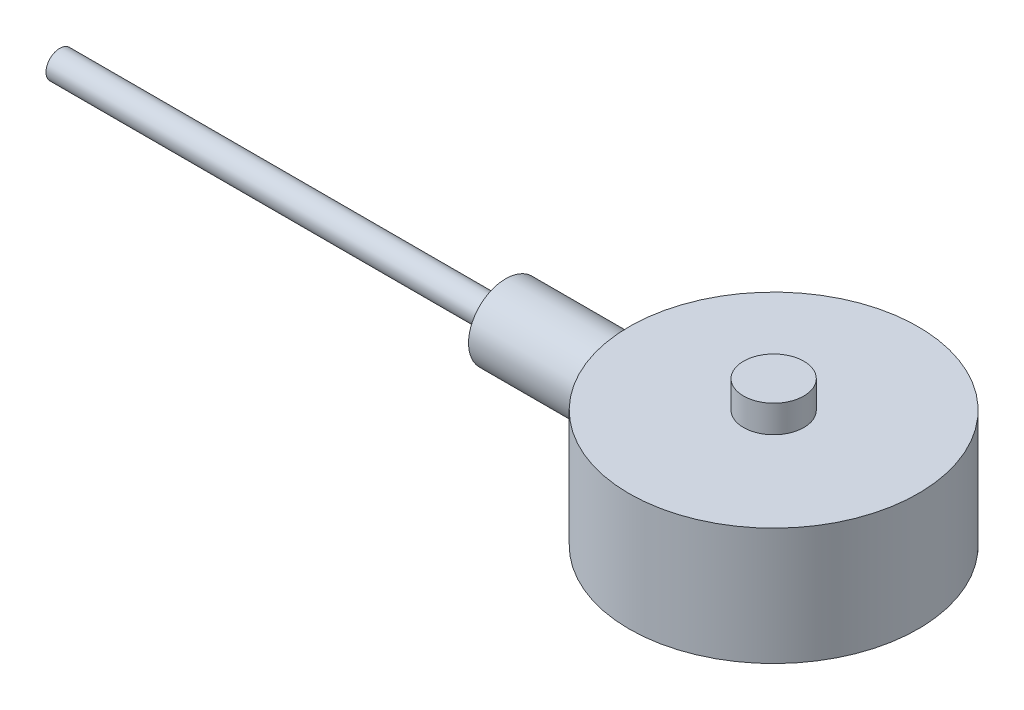
ISO-10303-21;
HEADER;
FILE_DESCRIPTION(('STEP AP214'),'2;1');
FILE_NAME('part.step','',(''),(''),'','','');
FILE_SCHEMA(('AUTOMOTIVE_DESIGN { 1 0 10303 214 1 1 1 1 }'));
ENDSEC;
DATA;
#1=APPLICATION_CONTEXT('core data for automotive mechanical design processes');
#2=APPLICATION_PROTOCOL_DEFINITION('international standard','automotive_design',2000,#1);
#3=PRODUCT_CONTEXT('',#1,'mechanical');
#4=PRODUCT('Part','Part','',(#3));
#5=PRODUCT_RELATED_PRODUCT_CATEGORY('part','',(#4));
#6=PRODUCT_DEFINITION_FORMATION('','',#4);
#7=PRODUCT_DEFINITION_CONTEXT('part definition',#1,'design');
#8=PRODUCT_DEFINITION('design','',#6,#7);
#9=PRODUCT_DEFINITION_SHAPE('','',#8);
#10=(LENGTH_UNIT() NAMED_UNIT(*) SI_UNIT(.MILLI.,.METRE.));
#11=(NAMED_UNIT(*) PLANE_ANGLE_UNIT() SI_UNIT($,.RADIAN.));
#12=(NAMED_UNIT(*) SI_UNIT($,.STERADIAN.) SOLID_ANGLE_UNIT());
#13=UNCERTAINTY_MEASURE_WITH_UNIT(LENGTH_MEASURE(1.E-05),#10,'distance_accuracy_value','');
#14=(GEOMETRIC_REPRESENTATION_CONTEXT(3) GLOBAL_UNCERTAINTY_ASSIGNED_CONTEXT((#13)) GLOBAL_UNIT_ASSIGNED_CONTEXT((#10,
#11,#12)) REPRESENTATION_CONTEXT('',''));
#15=CARTESIAN_POINT('',(0.,0.,0.));
#16=DIRECTION('',(0.,0.,1.));
#17=DIRECTION('',(1.,0.,0.));
#18=AXIS2_PLACEMENT_3D('',#15,#16,#17);
#19=CARTESIAN_POINT('',(0.,20.6,0.));
#20=DIRECTION('',(0.,-1.,0.));
#21=DIRECTION('',(0.,0.,-1.));
#22=AXIS2_PLACEMENT_3D('',#19,#20,#21);
#23=CYLINDRICAL_SURFACE('',#22,25.4);
#24=CARTESIAN_POINT('',(0.,20.6,0.));
#25=DIRECTION('',(0.,1.,0.));
#26=DIRECTION('',(0.,0.,1.));
#27=AXIS2_PLACEMENT_3D('',#24,#25,#26);
#28=CIRCLE('',#27,25.4);
#29=CARTESIAN_POINT('',(0.,20.6,25.4));
#30=VERTEX_POINT('',#29);
#31=EDGE_CURVE('E148',#30,#30,#28,.T.);
#32=ORIENTED_EDGE('',*,*,#31,.F.);
#33=EDGE_LOOP('',(#32));
#34=FACE_BOUND('',#33,.T.);
#35=CARTESIAN_POINT('',(0.,0.,0.));
#36=DIRECTION('',(0.,1.,0.));
#37=DIRECTION('',(0.,0.,1.));
#38=AXIS2_PLACEMENT_3D('',#35,#36,#37);
#39=CIRCLE('',#38,25.4);
#40=CARTESIAN_POINT('',(0.,0.,25.4));
#41=VERTEX_POINT('',#40);
#42=EDGE_CURVE('E145',#41,#41,#39,.T.);
#43=ORIENTED_EDGE('',*,*,#42,.T.);
#44=EDGE_LOOP('',(#43));
#45=FACE_BOUND('',#44,.T.);
#46=CARTESIAN_POINT('',(-25.4,17.060710463196,0.));
#47=CARTESIAN_POINT('',(-25.4000035309781,17.0607161739469,-0.180358619735467));
#48=CARTESIAN_POINT('',(-25.3980762095038,17.0532405049561,-0.360656037255291));
#49=CARTESIAN_POINT('',(-25.3904285228486,17.0234147226726,-0.719985920177956));
#50=CARTESIAN_POINT('',(-25.38470775899,17.0010630459618,-0.899018250625549));
#51=CARTESIAN_POINT('',(-25.3696251248397,16.9416600714324,-1.25451223583821));
#52=CARTESIAN_POINT('',(-25.3602622448064,16.9046046970988,-1.43097316361933));
#53=CARTESIAN_POINT('',(-25.3381502614576,16.8160896920976,-1.78009664988875));
#54=CARTESIAN_POINT('',(-25.3253999096587,16.7646247502767,-1.95275778247063));
#55=CARTESIAN_POINT('',(-25.2968852927623,16.6478063229631,-2.29273876671654));
#56=CARTESIAN_POINT('',(-25.2811259857349,16.5824756655066,-2.46006688393031));
#57=CARTESIAN_POINT('',(-25.2469982439923,16.4383558007341,-2.78861503010073));
#58=CARTESIAN_POINT('',(-25.2286288455333,16.3595616199926,-2.94983277490007));
#59=CARTESIAN_POINT('',(-25.1897790724341,16.1891308854188,-3.26499972746324));
#60=CARTESIAN_POINT('',(-25.169299445795,16.0974988780271,-3.41895148274231));
#61=CARTESIAN_POINT('',(-25.1267646702903,15.9020153610447,-3.71869059750719));
#62=CARTESIAN_POINT('',(-25.104708921441,15.7981591882315,-3.86447480976796));
#63=CARTESIAN_POINT('',(-25.0361777269127,15.4650832725142,-4.29354444894935));
#64=CARTESIAN_POINT('',(-24.9880945331316,15.2175342762225,-4.56266684487257));
#65=CARTESIAN_POINT('',(-24.892974870596,14.680904613669,-5.05600849228562));
#66=CARTESIAN_POINT('',(-24.8459385274736,14.3918189933245,-5.28022237988001));
#67=CARTESIAN_POINT('',(-24.7797558992645,13.9305420846982,-5.57981842753432));
#68=CARTESIAN_POINT('',(-24.7582646826717,13.7707355488543,-5.67418613655783));
#69=CARTESIAN_POINT('',(-24.7175310486715,13.4434736235015,-5.84907888471117));
#70=CARTESIAN_POINT('',(-24.6982877550784,13.2760212497906,-5.92960932307542));
#71=CARTESIAN_POINT('',(-24.6626286220092,12.9345705748769,-6.07621986184053));
#72=CARTESIAN_POINT('',(-24.6462135373806,12.7605705411585,-6.14229610568932));
#73=CARTESIAN_POINT('',(-24.6167316475934,12.4073774509224,-6.2594066687505));
#74=CARTESIAN_POINT('',(-24.6036634429281,12.2281865999636,-6.31044727649983));
#75=CARTESIAN_POINT('',(-24.5815143780469,11.8696371510568,-6.39617633132587));
#76=CARTESIAN_POINT('',(-24.5723564332697,11.6903591289952,-6.43118200149018));
#77=CARTESIAN_POINT('',(-24.5579278365064,11.3294152462892,-6.48606103157617));
#78=CARTESIAN_POINT('',(-24.5526556737093,11.1477503416686,-6.50594027282484));
#79=CARTESIAN_POINT('',(-24.5461583464484,10.7833145767009,-6.53041128019899));
#80=CARTESIAN_POINT('',(-24.5449333333155,10.6005436752544,-6.53500247467418));
#81=CARTESIAN_POINT('',(-24.5465695004962,10.2352797980459,-6.5288541350792));
#82=CARTESIAN_POINT('',(-24.5494306200815,10.0527868181938,-6.5181148288521));
#83=CARTESIAN_POINT('',(-24.5590219036603,9.69417476563703,-6.48188098588797));
#84=CARTESIAN_POINT('',(-24.5656495850964,9.51801330039964,-6.45677716686732));
#85=CARTESIAN_POINT('',(-24.5825013454958,9.16843037164685,-6.39231852535284));
#86=CARTESIAN_POINT('',(-24.5927266581541,8.99500986940246,-6.35295881411013));
#87=CARTESIAN_POINT('',(-24.6164704013353,8.65221802467578,-6.26032484886127));
#88=CARTESIAN_POINT('',(-24.6299878092343,8.48284544269429,-6.20705491541828));
#89=CARTESIAN_POINT('',(-24.6599349502071,8.14916103691418,-6.08698894208121));
#90=CARTESIAN_POINT('',(-24.6763657791044,7.98485114473324,-6.0201878113543));
#91=CARTESIAN_POINT('',(-24.7118551572406,7.66077293983746,-5.87281993550976));
#92=CARTESIAN_POINT('',(-24.7309388405972,7.5010681867001,-5.79211951019336));
#93=CARTESIAN_POINT('',(-24.7710759555629,7.18894302090554,-5.61798702400118));
#94=CARTESIAN_POINT('',(-24.7921301065475,7.03652529951003,-5.52455030765132));
#95=CARTESIAN_POINT('',(-24.8356199541376,6.7400212021732,-5.32563051835713));
#96=CARTESIAN_POINT('',(-24.8580553668051,6.59593312568483,-5.22014991741999));
#97=CARTESIAN_POINT('',(-24.9037161185589,6.31689409857409,-4.9977803347951));
#98=CARTESIAN_POINT('',(-24.9269417510977,6.18194659924261,-4.88088708415318));
#99=CARTESIAN_POINT('',(-24.9742566869714,5.91819236135995,-4.63280872782293));
#100=CARTESIAN_POINT('',(-24.9983510438618,5.78969004509387,-4.5013007125316));
#101=CARTESIAN_POINT('',(-25.0460531047415,5.54413675487309,-4.22782372307068));
#102=CARTESIAN_POINT('',(-25.069660621959,5.42709011357271,-4.08585082629222));
#103=CARTESIAN_POINT('',(-25.115717055766,5.20534047978677,-3.79246545137677));
#104=CARTESIAN_POINT('',(-25.1381663410799,5.10063354514044,-3.64105601168992));
#105=CARTESIAN_POINT('',(-25.1812985858973,4.90423184195601,-3.3297007236838));
#106=CARTESIAN_POINT('',(-25.2019808984577,4.81254183125436,-3.16975178332222));
#107=CARTESIAN_POINT('',(-25.2410630872351,4.64259496994694,-2.8418464888937));
#108=CARTESIAN_POINT('',(-25.2594543320955,4.56438851635589,-2.67386296865369));
#109=CARTESIAN_POINT('',(-25.2933425739263,4.42244070325404,-2.33160653777806));
#110=CARTESIAN_POINT('',(-25.3088395783944,4.3586993062711,-2.15733364343661));
#111=CARTESIAN_POINT('',(-25.336491439891,4.24622119072175,-1.80378312855721));
#112=CARTESIAN_POINT('',(-25.3486468708676,4.19748189522465,-1.62450637331575));
#113=CARTESIAN_POINT('',(-25.3692656794814,4.11541614896905,-1.26224725927728));
#114=CARTESIAN_POINT('',(-25.3777290717664,4.08208963706154,-1.0792649151849));
#115=CARTESIAN_POINT('',(-25.3905402453667,4.031836424581,-0.715966314009493));
#116=CARTESIAN_POINT('',(-25.394993037518,4.01449098807018,-0.53571158341127));
#117=CARTESIAN_POINT('',(-25.4000445032168,3.99482336022459,-0.174331538846448));
#118=CARTESIAN_POINT('',(-25.4006432428298,3.99250091136791,0.00679376014372783));
#119=CARTESIAN_POINT('',(-25.3979699596305,4.00289883496963,0.368568341260164));
#120=CARTESIAN_POINT('',(-25.3946982378243,4.01561803763706,0.54921765930854));
#121=CARTESIAN_POINT('',(-25.3843761915179,4.0559862512612,0.908726132253352));
#122=CARTESIAN_POINT('',(-25.3773259628138,4.08363488371411,1.08758533241731));
#123=CARTESIAN_POINT('',(-25.3597837002629,4.15306970116331,1.43941106586999));
#124=CARTESIAN_POINT('',(-25.3493479601928,4.19462498292618,1.61242606263673));
#125=CARTESIAN_POINT('',(-25.3252864401482,4.29163093106461,1.95428508242246));
#126=CARTESIAN_POINT('',(-25.3116606813068,4.34708150538704,2.12312913306486));
#127=CARTESIAN_POINT('',(-25.2815760335769,4.47146345350296,2.45556049754717));
#128=CARTESIAN_POINT('',(-25.2651164486537,4.54039813978538,2.61914650818357));
#129=CARTESIAN_POINT('',(-25.2298036347352,4.69120240590367,2.93990428963968));
#130=CARTESIAN_POINT('',(-25.2109511930313,4.77306773349017,3.09707814779396));
#131=CARTESIAN_POINT('',(-25.1709624145902,4.95083591204276,3.40698134287536));
#132=CARTESIAN_POINT('',(-25.1497896628223,5.04697471553973,3.55957064201657));
#133=CARTESIAN_POINT('',(-25.1060347176261,5.25138883928119,3.856096276183));
#134=CARTESIAN_POINT('',(-25.0834529984947,5.35966008507962,4.00003549137178));
#135=CARTESIAN_POINT('',(-25.0374621849727,5.58769880338152,4.27848256426247));
#136=CARTESIAN_POINT('',(-25.0140526720174,5.70747214586174,4.41298554503532));
#137=CARTESIAN_POINT('',(-24.9670494419054,5.95764695467529,4.6715855223184));
#138=CARTESIAN_POINT('',(-24.9434557913539,6.08804472570206,4.79568610669874));
#139=CARTESIAN_POINT('',(-24.8960884970365,6.36227033588621,5.03588729586373));
#140=CARTESIAN_POINT('',(-24.8723266612613,6.5063625558369,5.15168862669662));
#141=CARTESIAN_POINT('',(-24.8259551533404,6.80390640287076,5.37070580978662));
#142=CARTESIAN_POINT('',(-24.8033450641009,6.95735459691149,5.47392623722789));
#143=CARTESIAN_POINT('',(-24.7599173920242,7.27269544177062,5.66712464601436));
#144=CARTESIAN_POINT('',(-24.7391004668928,7.434591156347,5.75709777695949));
#145=CARTESIAN_POINT('',(-24.6998956162503,7.7656094824702,5.92304204635643));
#146=CARTESIAN_POINT('',(-24.6815067127582,7.93472914773452,5.99901882729192));
#147=CARTESIAN_POINT('',(-24.647801994074,8.27811368155004,6.1360255737855));
#148=CARTESIAN_POINT('',(-24.6324695978348,8.45234455991824,6.19713660533851));
#149=CARTESIAN_POINT('',(-24.6052278107054,8.80553472719467,6.30442945287795));
#150=CARTESIAN_POINT('',(-24.5933170953133,8.98449215712682,6.35061704645788));
#151=CARTESIAN_POINT('',(-24.5732851359856,9.3458820354511,6.42769368028584));
#152=CARTESIAN_POINT('',(-24.5651638796651,9.52831447248415,6.45858277053255));
#153=CARTESIAN_POINT('',(-24.5529705684265,9.89527409276934,6.50478362641228));
#154=CARTESIAN_POINT('',(-24.5488984090518,10.0798012218594,6.52009579389121));
#155=CARTESIAN_POINT('',(-24.5449947518596,10.4438611359756,6.53477511817531));
#156=CARTESIAN_POINT('',(-24.5450370789063,10.6233736101813,6.53461669647135));
#157=CARTESIAN_POINT('',(-24.5490481076099,10.9817959724091,6.51953205805187));
#158=CARTESIAN_POINT('',(-24.5530181617635,11.1607056315606,6.504600754355));
#159=CARTESIAN_POINT('',(-24.5647639195728,11.5164945443186,6.4601006850177));
#160=CARTESIAN_POINT('',(-24.5725381175147,11.6933745729448,6.43053771066839));
#161=CARTESIAN_POINT('',(-24.5916615614137,12.0439864185386,6.35701365520471));
#162=CARTESIAN_POINT('',(-24.6030121383768,12.2177170379055,6.31304721336895));
#163=CARTESIAN_POINT('',(-24.6288598045935,12.5595445715163,6.21144020862437));
#164=CARTESIAN_POINT('',(-24.6433340879972,12.7276726250862,6.153898487639));
#165=CARTESIAN_POINT('',(-24.6750668353159,13.0585138199347,6.02540076848334));
#166=CARTESIAN_POINT('',(-24.6923262489812,13.2212250911362,5.95444019295923));
#167=CARTESIAN_POINT('',(-24.7291416410129,13.5401166496885,5.79964470200644));
#168=CARTESIAN_POINT('',(-24.7486974695528,13.696297362216,5.71581062638211));
#169=CARTESIAN_POINT('',(-24.789572098237,14.0011672449633,5.53584917266127));
#170=CARTESIAN_POINT('',(-24.8108909496165,14.1498561972633,5.43972143725529));
#171=CARTESIAN_POINT('',(-24.8553278151416,14.4428334088727,5.2329877658674));
#172=CARTESIAN_POINT('',(-24.8784793025896,14.58688579926,5.12205462692487));
#173=CARTESIAN_POINT('',(-24.9253904667354,14.8651454199484,4.88866742525974));
#174=CARTESIAN_POINT('',(-24.9491499489401,14.9993557468318,4.76621701410294));
#175=CARTESIAN_POINT('',(-24.9966476757251,15.2571951165901,4.51049035636221));
#176=CARTESIAN_POINT('',(-25.0203859000117,15.3808179808914,4.37720787568704));
#177=CARTESIAN_POINT('',(-25.0671733741027,15.616540371732,4.10078752227405));
#178=CARTESIAN_POINT('',(-25.0902228700796,15.7286440513846,3.95765323279589));
#179=CARTESIAN_POINT('',(-25.1354636419709,15.9427323506578,3.65946058628997));
#180=CARTESIAN_POINT('',(-25.157628703303,16.0444711397004,3.504221594272));
#181=CARTESIAN_POINT('',(-25.1999675870972,16.2344421443538,3.18550903234973));
#182=CARTESIAN_POINT('',(-25.2201421399944,16.3226793211004,3.02203851658695));
#183=CARTESIAN_POINT('',(-25.2579279031718,16.4849814541508,2.6879916828963));
#184=CARTESIAN_POINT('',(-25.2755401422996,16.5590521025301,2.51741825259004));
#185=CARTESIAN_POINT('',(-25.3077035546486,16.6924497215755,2.1703804933399));
#186=CARTESIAN_POINT('',(-25.3222551681882,16.7517788132665,1.99391701600906));
#187=CARTESIAN_POINT('',(-25.3561182054524,16.8885043239949,1.52113319238525));
#188=CARTESIAN_POINT('',(-25.3724682506856,16.9529651685069,1.22074640600019));
#189=CARTESIAN_POINT('',(-25.3944056904297,17.0390615700823,0.613513732949147));
#190=CARTESIAN_POINT('',(-25.3999939961871,17.0607007530595,0.306668395383228));
#191=CARTESIAN_POINT('',(-25.4,17.060710463196,0.));
#192=B_SPLINE_CURVE_WITH_KNOTS('',3,(#46,#47,#48,#49,#50,#51,#52,#53,#54,#55,#56,#57,#58,#59,
#60,#61,#62,#63,#64,#65,#66,#67,#68,#69,#70,#71,#72,#73,#74,#75,#76,#77,#78,#79,#80,#81,#82,#83,
#84,#85,#86,#87,#88,#89,#90,#91,#92,#93,#94,#95,#96,#97,#98,#99,#100,#101,#102,#103,#104,#105,
#106,#107,#108,#109,#110,#111,#112,#113,#114,#115,#116,#117,#118,#119,#120,#121,#122,#123,#124,
#125,#126,#127,#128,#129,#130,#131,#132,#133,#134,#135,#136,#137,#138,#139,#140,#141,#142,#143,
#144,#145,#146,#147,#148,#149,#150,#151,#152,#153,#154,#155,#156,#157,#158,#159,#160,#161,#162,
#163,#164,#165,#166,#167,#168,#169,#170,#171,#172,#173,#174,#175,#176,#177,#178,#179,#180,#181,
#182,#183,#184,#185,#186,#187,#188,#189,#190,#191),.UNSPECIFIED.,.T.,.F.,(4,2,2,2,2,2,2,2,2,2,2,
2,2,2,2,2,2,2,2,2,2,2,2,2,2,2,2,2,2,2,2,2,2,2,2,2,2,2,2,2,2,2,2,2,2,2,2,2,2,2,2,2,2,2,2,2,2,2,2,
2,2,2,2,2,2,2,2,2,2,2,2,2,4),(0.,0.540805460832679,1.08166776746452,1.62268012992808,
2.1638921646559,2.70421998418226,3.24474783402493,3.78508474072827,4.32562844500658,
5.42665028080268,6.52780354489698,7.08771856717066,7.64741461478567,8.20725981435129,
8.76687052952005,9.31487357120513,9.86266343406945,10.4104737796497,10.9582759837157,
11.4918416996737,12.0255905639265,12.559173840724,13.0929582412997,13.632196751513,
14.1716328998534,14.7109585272852,15.2504866705369,15.8061531255951,16.3620289338324,
16.9177266724798,17.4736270050067,18.0315620669944,18.5894956836185,19.1473334097008,
19.7051689225873,20.2479338570849,20.7906894875592,21.3334029106416,21.8761025750308,
22.4102048933668,22.9443036734903,23.4785338247588,24.0125886584833,24.5567315875141,
25.1006923212602,25.6449321501534,26.1889834872703,26.7474568443713,27.3057264966461,
27.8642000496278,28.4224479647094,28.9775797315727,29.532496321511,30.0874110978548,
30.6423115584129,31.1802009360697,31.7182755982155,32.2561374577333,32.7941997279871,
33.3284590937782,33.8629010325241,34.3973081216839,34.9317307466674,35.4809518955893,
36.0299994964777,36.5793653547793,37.1285324452138,37.688630488089,38.2485222274595,
38.8081885289438,39.3677742585835,40.287397551644,41.2069429724911),.UNSPECIFIED.);
#193=CARTESIAN_POINT('',(-25.4,17.060710463196,0.));
#194=VERTEX_POINT('',#193);
#195=EDGE_CURVE('E11',#194,#194,#192,.T.);
#196=ORIENTED_EDGE('',*,*,#195,.F.);
#197=EDGE_LOOP('',(#196));
#198=FACE_BOUND('',#197,.T.);
#199=ADVANCED_FACE('F39',(#34,#45,#198),#23,.T.);
#200=CARTESIAN_POINT('',(0.,20.6,0.));
#201=DIRECTION('',(0.,1.,0.));
#202=DIRECTION('',(0.,0.,1.));
#203=AXIS2_PLACEMENT_3D('',#200,#201,#202);
#204=PLANE('',#203);
#205=CARTESIAN_POINT('',(0.,20.6,0.));
#206=DIRECTION('',(0.,1.,0.));
#207=DIRECTION('',(0.,0.,1.));
#208=AXIS2_PLACEMENT_3D('',#205,#206,#207);
#209=CIRCLE('',#208,5.3);
#210=CARTESIAN_POINT('',(0.,20.6,5.3));
#211=VERTEX_POINT('',#210);
#212=EDGE_CURVE('E51',#211,#211,#209,.T.);
#213=ORIENTED_EDGE('',*,*,#212,.F.);
#214=EDGE_LOOP('',(#213));
#215=FACE_BOUND('',#214,.T.);
#216=ORIENTED_EDGE('',*,*,#31,.T.);
#217=EDGE_LOOP('',(#216));
#218=FACE_BOUND('',#217,.T.);
#219=ADVANCED_FACE('F158',(#215,#218),#204,.T.);
#220=CARTESIAN_POINT('',(0.,0.,0.));
#221=DIRECTION('',(0.,1.,0.));
#222=DIRECTION('',(0.,0.,1.));
#223=AXIS2_PLACEMENT_3D('',#220,#221,#222);
#224=PLANE('',#223);
#225=CARTESIAN_POINT('',(-19.7710219957415,0.,8.18942545261125));
#226=DIRECTION('',(0.,-1.,0.));
#227=DIRECTION('',(0.,0.,-1.));
#228=AXIS2_PLACEMENT_3D('',#225,#226,#227);
#229=CIRCLE('',#228,2.49999999999999);
#230=CARTESIAN_POINT('',(-19.7710219957415,0.,5.68942545261126));
#231=VERTEX_POINT('',#230);
#232=EDGE_CURVE('E87',#231,#231,#229,.T.);
#233=ORIENTED_EDGE('',*,*,#232,.F.);
#234=EDGE_LOOP('',(#233));
#235=FACE_BOUND('',#234,.T.);
#236=CARTESIAN_POINT('',(-8.18942545261343,0.,19.7710219957404));
#237=DIRECTION('',(0.,-1.,0.));
#238=DIRECTION('',(0.,0.,-1.));
#239=AXIS2_PLACEMENT_3D('',#236,#237,#238);
#240=CIRCLE('',#239,2.49999999999999);
#241=CARTESIAN_POINT('',(-8.18942545261343,0.,17.2710219957404));
#242=VERTEX_POINT('',#241);
#243=EDGE_CURVE('E86',#242,#242,#240,.T.);
#244=ORIENTED_EDGE('',*,*,#243,.F.);
#245=EDGE_LOOP('',(#244));
#246=FACE_BOUND('',#245,.T.);
#247=CARTESIAN_POINT('',(8.18942545261242,0.,19.7710219957411));
#248=DIRECTION('',(0.,-1.,0.));
#249=DIRECTION('',(0.,0.,-1.));
#250=AXIS2_PLACEMENT_3D('',#247,#248,#249);
#251=CIRCLE('',#250,2.49999999999999);
#252=CARTESIAN_POINT('',(8.18942545261242,0.,17.2710219957411));
#253=VERTEX_POINT('',#252);
#254=EDGE_CURVE('E97',#253,#253,#251,.T.);
#255=ORIENTED_EDGE('',*,*,#254,.F.);
#256=EDGE_LOOP('',(#255));
#257=FACE_BOUND('',#256,.T.);
#258=CARTESIAN_POINT('',(19.7710219957415,0.,8.18942545261294));
#259=DIRECTION('',(0.,-1.,0.));
#260=DIRECTION('',(0.,0.,-1.));
#261=AXIS2_PLACEMENT_3D('',#258,#259,#260);
#262=CIRCLE('',#261,2.49999999999999);
#263=CARTESIAN_POINT('',(19.7710219957415,0.,5.68942545261295));
#264=VERTEX_POINT('',#263);
#265=EDGE_CURVE('E103',#264,#264,#262,.T.);
#266=ORIENTED_EDGE('',*,*,#265,.F.);
#267=EDGE_LOOP('',(#266));
#268=FACE_BOUND('',#267,.T.);
#269=CARTESIAN_POINT('',(19.7710219957422,0.,-8.18942545261291));
#270=DIRECTION('',(0.,-1.,0.));
#271=DIRECTION('',(0.,0.,-1.));
#272=AXIS2_PLACEMENT_3D('',#269,#270,#271);
#273=CIRCLE('',#272,2.49999999999999);
#274=CARTESIAN_POINT('',(19.7710219957422,0.,-10.6894254526129));
#275=VERTEX_POINT('',#274);
#276=EDGE_CURVE('E109',#275,#275,#273,.T.);
#277=ORIENTED_EDGE('',*,*,#276,.F.);
#278=EDGE_LOOP('',(#277));
#279=FACE_BOUND('',#278,.T.);
#280=CARTESIAN_POINT('',(8.1894254526141,0.,-19.771021995742));
#281=DIRECTION('',(0.,-1.,0.));
#282=DIRECTION('',(0.,0.,-1.));
#283=AXIS2_PLACEMENT_3D('',#280,#281,#282);
#284=CIRCLE('',#283,2.49999999999999);
#285=CARTESIAN_POINT('',(8.1894254526141,0.,-22.271021995742));
#286=VERTEX_POINT('',#285);
#287=EDGE_CURVE('E115',#286,#286,#284,.T.);
#288=ORIENTED_EDGE('',*,*,#287,.F.);
#289=EDGE_LOOP('',(#288));
#290=FACE_BOUND('',#289,.T.);
#291=CARTESIAN_POINT('',(-8.18942545261174,0.,-19.7710219957427));
#292=DIRECTION('',(0.,-1.,0.));
#293=DIRECTION('',(0.,0.,-1.));
#294=AXIS2_PLACEMENT_3D('',#291,#292,#293);
#295=CIRCLE('',#294,2.49999999999999);
#296=CARTESIAN_POINT('',(-8.18942545261174,0.,-22.2710219957427));
#297=VERTEX_POINT('',#296);
#298=EDGE_CURVE('E121',#297,#297,#295,.T.);
#299=ORIENTED_EDGE('',*,*,#298,.F.);
#300=EDGE_LOOP('',(#299));
#301=FACE_BOUND('',#300,.T.);
#302=CARTESIAN_POINT('',(-19.7710219957408,0.,-8.18942545261459));
#303=DIRECTION('',(0.,-1.,0.));
#304=DIRECTION('',(0.,0.,-1.));
#305=AXIS2_PLACEMENT_3D('',#302,#303,#304);
#306=CIRCLE('',#305,2.49999999999999);
#307=CARTESIAN_POINT('',(-19.7710219957408,0.,-10.6894254526146));
#308=VERTEX_POINT('',#307);
#309=EDGE_CURVE('E127',#308,#308,#306,.T.);
#310=ORIENTED_EDGE('',*,*,#309,.F.);
#311=EDGE_LOOP('',(#310));
#312=FACE_BOUND('',#311,.T.);
#313=ORIENTED_EDGE('',*,*,#42,.F.);
#314=EDGE_LOOP('',(#313));
#315=FACE_BOUND('',#314,.T.);
#316=ADVANCED_FACE('F155',(#235,#246,#257,#268,#279,#290,#301,#312,#315),#224,.F.);
#317=CARTESIAN_POINT('',(0.,25.4,0.));
#318=DIRECTION('',(0.,-1.,0.));
#319=DIRECTION('',(0.,0.,-1.));
#320=AXIS2_PLACEMENT_3D('',#317,#318,#319);
#321=CYLINDRICAL_SURFACE('',#320,5.3);
#322=CARTESIAN_POINT('',(0.,25.4,0.));
#323=DIRECTION('',(0.,1.,0.));
#324=DIRECTION('',(0.,0.,1.));
#325=AXIS2_PLACEMENT_3D('',#322,#323,#324);
#326=CIRCLE('',#325,5.3);
#327=CARTESIAN_POINT('',(0.,25.4,5.3));
#328=VERTEX_POINT('',#327);
#329=EDGE_CURVE('E142',#328,#328,#326,.T.);
#330=ORIENTED_EDGE('',*,*,#329,.F.);
#331=EDGE_LOOP('',(#330));
#332=FACE_BOUND('',#331,.T.);
#333=ORIENTED_EDGE('',*,*,#212,.T.);
#334=EDGE_LOOP('',(#333));
#335=FACE_BOUND('',#334,.T.);
#336=ADVANCED_FACE('F157',(#332,#335),#321,.T.);
#337=CARTESIAN_POINT('',(0.,25.4,0.));
#338=DIRECTION('',(0.,1.,0.));
#339=DIRECTION('',(0.,0.,1.));
#340=AXIS2_PLACEMENT_3D('',#337,#338,#339);
#341=PLANE('',#340);
#342=ORIENTED_EDGE('',*,*,#329,.T.);
#343=EDGE_LOOP('',(#342));
#344=FACE_BOUND('',#343,.T.);
#345=ADVANCED_FACE('F164',(#344),#341,.T.);
#346=CARTESIAN_POINT('',(-25.075504061391,10.5278569270352,0.));
#347=DIRECTION('',(1.,0.,0.));
#348=DIRECTION('',(0.,1.,0.));
#349=AXIS2_PLACEMENT_3D('',#346,#347,#348);
#350=CYLINDRICAL_SURFACE('',#349,6.5328535361608);
#351=CARTESIAN_POINT('',(-47.075504061391,10.5278569270352,0.));
#352=DIRECTION('',(1.,0.,0.));
#353=DIRECTION('',(0.,1.,0.));
#354=AXIS2_PLACEMENT_3D('',#351,#352,#353);
#355=CIRCLE('',#354,6.5328535361608);
#356=CARTESIAN_POINT('',(-47.075504061391,17.060710463196,0.));
#357=VERTEX_POINT('',#356);
#358=EDGE_CURVE('E136',#357,#357,#355,.T.);
#359=ORIENTED_EDGE('',*,*,#358,.T.);
#360=EDGE_LOOP('',(#359));
#361=FACE_BOUND('',#360,.T.);
#362=ORIENTED_EDGE('',*,*,#195,.T.);
#363=EDGE_LOOP('',(#362));
#364=FACE_BOUND('',#363,.T.);
#365=ADVANCED_FACE('F197',(#361,#364),#350,.T.);
#366=CARTESIAN_POINT('',(-25.075504061391,10.5278569270352,0.));
#367=DIRECTION('',(1.,0.,0.));
#368=DIRECTION('',(0.,1.,0.));
#369=AXIS2_PLACEMENT_3D('',#366,#367,#368);
#370=CYLINDRICAL_SURFACE('',#369,2.41553558702507);
#371=CARTESIAN_POINT('',(-125.419033551748,10.5278569270352,0.));
#372=DIRECTION('',(1.,0.,0.));
#373=DIRECTION('',(0.,1.,0.));
#374=AXIS2_PLACEMENT_3D('',#371,#372,#373);
#375=CIRCLE('',#374,2.41553558702507);
#376=CARTESIAN_POINT('',(-125.419033551748,12.9433925140603,0.));
#377=VERTEX_POINT('',#376);
#378=EDGE_CURVE('E139',#377,#377,#375,.T.);
#379=ORIENTED_EDGE('',*,*,#378,.T.);
#380=EDGE_LOOP('',(#379));
#381=FACE_BOUND('',#380,.T.);
#382=CARTESIAN_POINT('',(-47.075504061391,10.5278569270352,0.));
#383=DIRECTION('',(1.,0.,0.));
#384=DIRECTION('',(0.,1.,0.));
#385=AXIS2_PLACEMENT_3D('',#382,#383,#384);
#386=CIRCLE('',#385,2.41553558702507);
#387=CARTESIAN_POINT('',(-47.075504061391,12.9433925140603,0.));
#388=VERTEX_POINT('',#387);
#389=EDGE_CURVE('E133',#388,#388,#386,.T.);
#390=ORIENTED_EDGE('',*,*,#389,.F.);
#391=EDGE_LOOP('',(#390));
#392=FACE_BOUND('',#391,.T.);
#393=ADVANCED_FACE('F206',(#381,#392),#370,.T.);
#394=CARTESIAN_POINT('',(-125.419033551748,12.9433925140603,0.));
#395=DIRECTION('',(-1.,0.,0.));
#396=DIRECTION('',(0.,-1.,0.));
#397=AXIS2_PLACEMENT_3D('',#394,#395,#396);
#398=PLANE('',#397);
#399=ORIENTED_EDGE('',*,*,#378,.F.);
#400=EDGE_LOOP('',(#399));
#401=FACE_BOUND('',#400,.T.);
#402=ADVANCED_FACE('F213',(#401),#398,.T.);
#403=CARTESIAN_POINT('',(-47.075504061391,17.060710463196,0.));
#404=DIRECTION('',(-1.,0.,0.));
#405=DIRECTION('',(0.,-1.,0.));
#406=AXIS2_PLACEMENT_3D('',#403,#404,#405);
#407=PLANE('',#406);
#408=ORIENTED_EDGE('',*,*,#389,.T.);
#409=EDGE_LOOP('',(#408));
#410=FACE_BOUND('',#409,.T.);
#411=ORIENTED_EDGE('',*,*,#358,.F.);
#412=EDGE_LOOP('',(#411));
#413=FACE_BOUND('',#412,.T.);
#414=ADVANCED_FACE('F221',(#410,#413),#407,.T.);
#415=CARTESIAN_POINT('',(-19.7710219957408,10.2,-8.18942545261459));
#416=DIRECTION('',(0.,-1.,0.));
#417=DIRECTION('',(0.,0.,-1.));
#418=AXIS2_PLACEMENT_3D('',#415,#416,#417);
#419=CONICAL_SURFACE('',#418,2.5,1.02974425867665);
#420=CARTESIAN_POINT('',(-19.7710219957409,11.7021515475689,-8.18942545261459));
#421=VERTEX_POINT('',#420);
#422=VERTEX_LOOP('',#421);
#423=FACE_BOUND('',#422,.T.);
#424=CARTESIAN_POINT('',(-19.7710219957408,10.2,-8.18942545261459));
#425=DIRECTION('',(0.,-1.,0.));
#426=DIRECTION('',(0.,0.,-1.));
#427=AXIS2_PLACEMENT_3D('',#424,#425,#426);
#428=CIRCLE('',#427,2.5);
#429=CARTESIAN_POINT('',(-19.7710219957408,10.2,-10.6894254526146));
#430=VERTEX_POINT('',#429);
#431=EDGE_CURVE('E130',#430,#430,#428,.T.);
#432=ORIENTED_EDGE('',*,*,#431,.T.);
#433=EDGE_LOOP('',(#432));
#434=FACE_BOUND('',#433,.T.);
#435=ADVANCED_FACE('F229',(#423,#434),#419,.F.);
#436=CARTESIAN_POINT('',(-19.7710219957408,0.,-8.18942545261459));
#437=DIRECTION('',(0.,-1.,0.));
#438=DIRECTION('',(0.,0.,-1.));
#439=AXIS2_PLACEMENT_3D('',#436,#437,#438);
#440=CYLINDRICAL_SURFACE('',#439,2.49999999999999);
#441=ORIENTED_EDGE('',*,*,#431,.F.);
#442=EDGE_LOOP('',(#441));
#443=FACE_BOUND('',#442,.T.);
#444=ORIENTED_EDGE('',*,*,#309,.T.);
#445=EDGE_LOOP('',(#444));
#446=FACE_BOUND('',#445,.T.);
#447=ADVANCED_FACE('F238',(#443,#446),#440,.F.);
#448=CARTESIAN_POINT('',(-8.18942545261174,10.2,-19.7710219957427));
#449=DIRECTION('',(0.,-1.,0.));
#450=DIRECTION('',(0.,0.,-1.));
#451=AXIS2_PLACEMENT_3D('',#448,#449,#450);
#452=CONICAL_SURFACE('',#451,2.5,1.02974425867665);
#453=CARTESIAN_POINT('',(-8.18942545261174,11.7021515475689,-19.7710219957427));
#454=VERTEX_POINT('',#453);
#455=VERTEX_LOOP('',#454);
#456=FACE_BOUND('',#455,.T.);
#457=CARTESIAN_POINT('',(-8.18942545261174,10.2,-19.7710219957427));
#458=DIRECTION('',(0.,-1.,0.));
#459=DIRECTION('',(0.,0.,-1.));
#460=AXIS2_PLACEMENT_3D('',#457,#458,#459);
#461=CIRCLE('',#460,2.5);
#462=CARTESIAN_POINT('',(-8.18942545261174,10.2,-22.2710219957427));
#463=VERTEX_POINT('',#462);
#464=EDGE_CURVE('E124',#463,#463,#461,.T.);
#465=ORIENTED_EDGE('',*,*,#464,.T.);
#466=EDGE_LOOP('',(#465));
#467=FACE_BOUND('',#466,.T.);
#468=ADVANCED_FACE('F246',(#456,#467),#452,.F.);
#469=CARTESIAN_POINT('',(-8.18942545261174,0.,-19.7710219957427));
#470=DIRECTION('',(0.,-1.,0.));
#471=DIRECTION('',(0.,0.,-1.));
#472=AXIS2_PLACEMENT_3D('',#469,#470,#471);
#473=CYLINDRICAL_SURFACE('',#472,2.49999999999999);
#474=ORIENTED_EDGE('',*,*,#464,.F.);
#475=EDGE_LOOP('',(#474));
#476=FACE_BOUND('',#475,.T.);
#477=ORIENTED_EDGE('',*,*,#298,.T.);
#478=EDGE_LOOP('',(#477));
#479=FACE_BOUND('',#478,.T.);
#480=ADVANCED_FACE('F255',(#476,#479),#473,.F.);
#481=CARTESIAN_POINT('',(8.1894254526141,10.2,-19.771021995742));
#482=DIRECTION('',(0.,-1.,0.));
#483=DIRECTION('',(0.,0.,-1.));
#484=AXIS2_PLACEMENT_3D('',#481,#482,#483);
#485=CONICAL_SURFACE('',#484,2.5,1.02974425867665);
#486=CARTESIAN_POINT('',(8.1894254526141,11.7021515475689,-19.771021995742));
#487=VERTEX_POINT('',#486);
#488=VERTEX_LOOP('',#487);
#489=FACE_BOUND('',#488,.T.);
#490=CARTESIAN_POINT('',(8.1894254526141,10.2,-19.771021995742));
#491=DIRECTION('',(0.,-1.,0.));
#492=DIRECTION('',(0.,0.,-1.));
#493=AXIS2_PLACEMENT_3D('',#490,#491,#492);
#494=CIRCLE('',#493,2.5);
#495=CARTESIAN_POINT('',(8.1894254526141,10.2,-22.271021995742));
#496=VERTEX_POINT('',#495);
#497=EDGE_CURVE('E118',#496,#496,#494,.T.);
#498=ORIENTED_EDGE('',*,*,#497,.T.);
#499=EDGE_LOOP('',(#498));
#500=FACE_BOUND('',#499,.T.);
#501=ADVANCED_FACE('F262',(#489,#500),#485,.F.);
#502=CARTESIAN_POINT('',(8.1894254526141,0.,-19.771021995742));
#503=DIRECTION('',(0.,-1.,0.));
#504=DIRECTION('',(0.,0.,-1.));
#505=AXIS2_PLACEMENT_3D('',#502,#503,#504);
#506=CYLINDRICAL_SURFACE('',#505,2.49999999999999);
#507=ORIENTED_EDGE('',*,*,#497,.F.);
#508=EDGE_LOOP('',(#507));
#509=FACE_BOUND('',#508,.T.);
#510=ORIENTED_EDGE('',*,*,#287,.T.);
#511=EDGE_LOOP('',(#510));
#512=FACE_BOUND('',#511,.T.);
#513=ADVANCED_FACE('F271',(#509,#512),#506,.F.);
#514=CARTESIAN_POINT('',(19.7710219957422,10.2,-8.18942545261291));
#515=DIRECTION('',(0.,-1.,0.));
#516=DIRECTION('',(0.,0.,-1.));
#517=AXIS2_PLACEMENT_3D('',#514,#515,#516);
#518=CONICAL_SURFACE('',#517,2.5,1.02974425867665);
#519=CARTESIAN_POINT('',(19.7710219957422,11.7021515475689,-8.18942545261291));
#520=VERTEX_POINT('',#519);
#521=VERTEX_LOOP('',#520);
#522=FACE_BOUND('',#521,.T.);
#523=CARTESIAN_POINT('',(19.7710219957422,10.2,-8.18942545261291));
#524=DIRECTION('',(0.,-1.,0.));
#525=DIRECTION('',(0.,0.,-1.));
#526=AXIS2_PLACEMENT_3D('',#523,#524,#525);
#527=CIRCLE('',#526,2.5);
#528=CARTESIAN_POINT('',(19.7710219957422,10.2,-10.6894254526129));
#529=VERTEX_POINT('',#528);
#530=EDGE_CURVE('E112',#529,#529,#527,.T.);
#531=ORIENTED_EDGE('',*,*,#530,.T.);
#532=EDGE_LOOP('',(#531));
#533=FACE_BOUND('',#532,.T.);
#534=ADVANCED_FACE('F279',(#522,#533),#518,.F.);
#535=CARTESIAN_POINT('',(19.7710219957422,0.,-8.18942545261291));
#536=DIRECTION('',(0.,-1.,0.));
#537=DIRECTION('',(0.,0.,-1.));
#538=AXIS2_PLACEMENT_3D('',#535,#536,#537);
#539=CYLINDRICAL_SURFACE('',#538,2.5);
#540=ORIENTED_EDGE('',*,*,#530,.F.);
#541=EDGE_LOOP('',(#540));
#542=FACE_BOUND('',#541,.T.);
#543=ORIENTED_EDGE('',*,*,#276,.T.);
#544=EDGE_LOOP('',(#543));
#545=FACE_BOUND('',#544,.T.);
#546=ADVANCED_FACE('F288',(#542,#545),#539,.F.);
#547=CARTESIAN_POINT('',(19.7710219957415,10.2,8.18942545261294));
#548=DIRECTION('',(0.,-1.,0.));
#549=DIRECTION('',(0.,0.,-1.));
#550=AXIS2_PLACEMENT_3D('',#547,#548,#549);
#551=CONICAL_SURFACE('',#550,2.5,1.02974425867665);
#552=CARTESIAN_POINT('',(19.7710219957415,11.7021515475689,8.18942545261294));
#553=VERTEX_POINT('',#552);
#554=VERTEX_LOOP('',#553);
#555=FACE_BOUND('',#554,.T.);
#556=CARTESIAN_POINT('',(19.7710219957415,10.2,8.18942545261294));
#557=DIRECTION('',(0.,-1.,0.));
#558=DIRECTION('',(0.,0.,-1.));
#559=AXIS2_PLACEMENT_3D('',#556,#557,#558);
#560=CIRCLE('',#559,2.5);
#561=CARTESIAN_POINT('',(19.7710219957415,10.2,5.68942545261294));
#562=VERTEX_POINT('',#561);
#563=EDGE_CURVE('E106',#562,#562,#560,.T.);
#564=ORIENTED_EDGE('',*,*,#563,.T.);
#565=EDGE_LOOP('',(#564));
#566=FACE_BOUND('',#565,.T.);
#567=ADVANCED_FACE('F296',(#555,#566),#551,.F.);
#568=CARTESIAN_POINT('',(19.7710219957415,0.,8.18942545261294));
#569=DIRECTION('',(0.,-1.,0.));
#570=DIRECTION('',(0.,0.,-1.));
#571=AXIS2_PLACEMENT_3D('',#568,#569,#570);
#572=CYLINDRICAL_SURFACE('',#571,2.49999999999999);
#573=ORIENTED_EDGE('',*,*,#563,.F.);
#574=EDGE_LOOP('',(#573));
#575=FACE_BOUND('',#574,.T.);
#576=ORIENTED_EDGE('',*,*,#265,.T.);
#577=EDGE_LOOP('',(#576));
#578=FACE_BOUND('',#577,.T.);
#579=ADVANCED_FACE('F305',(#575,#578),#572,.F.);
#580=CARTESIAN_POINT('',(8.18942545261242,10.2,19.7710219957411));
#581=DIRECTION('',(0.,-1.,0.));
#582=DIRECTION('',(0.,0.,-1.));
#583=AXIS2_PLACEMENT_3D('',#580,#581,#582);
#584=CONICAL_SURFACE('',#583,2.5,1.02974425867665);
#585=CARTESIAN_POINT('',(8.18942545261242,11.7021515475689,19.7710219957411));
#586=VERTEX_POINT('',#585);
#587=VERTEX_LOOP('',#586);
#588=FACE_BOUND('',#587,.T.);
#589=CARTESIAN_POINT('',(8.18942545261242,10.2,19.7710219957411));
#590=DIRECTION('',(0.,-1.,0.));
#591=DIRECTION('',(0.,0.,-1.));
#592=AXIS2_PLACEMENT_3D('',#589,#590,#591);
#593=CIRCLE('',#592,2.5);
#594=CARTESIAN_POINT('',(8.18942545261242,10.2,17.2710219957411));
#595=VERTEX_POINT('',#594);
#596=EDGE_CURVE('E100',#595,#595,#593,.T.);
#597=ORIENTED_EDGE('',*,*,#596,.T.);
#598=EDGE_LOOP('',(#597));
#599=FACE_BOUND('',#598,.T.);
#600=ADVANCED_FACE('F313',(#588,#599),#584,.F.);
#601=CARTESIAN_POINT('',(8.18942545261242,0.,19.7710219957411));
#602=DIRECTION('',(0.,-1.,0.));
#603=DIRECTION('',(0.,0.,-1.));
#604=AXIS2_PLACEMENT_3D('',#601,#602,#603);
#605=CYLINDRICAL_SURFACE('',#604,2.49999999999999);
#606=ORIENTED_EDGE('',*,*,#596,.F.);
#607=EDGE_LOOP('',(#606));
#608=FACE_BOUND('',#607,.T.);
#609=ORIENTED_EDGE('',*,*,#254,.T.);
#610=EDGE_LOOP('',(#609));
#611=FACE_BOUND('',#610,.T.);
#612=ADVANCED_FACE('F322',(#608,#611),#605,.F.);
#613=CARTESIAN_POINT('',(-8.18942545261343,10.2,19.7710219957404));
#614=DIRECTION('',(0.,-1.,0.));
#615=DIRECTION('',(0.,0.,-1.));
#616=AXIS2_PLACEMENT_3D('',#613,#614,#615);
#617=CONICAL_SURFACE('',#616,2.5,1.02974425867665);
#618=CARTESIAN_POINT('',(-8.18942545261343,11.7021515475689,19.7710219957404));
#619=VERTEX_POINT('',#618);
#620=VERTEX_LOOP('',#619);
#621=FACE_BOUND('',#620,.T.);
#622=CARTESIAN_POINT('',(-8.18942545261343,10.2,19.7710219957404));
#623=DIRECTION('',(0.,-1.,0.));
#624=DIRECTION('',(0.,0.,-1.));
#625=AXIS2_PLACEMENT_3D('',#622,#623,#624);
#626=CIRCLE('',#625,2.5);
#627=CARTESIAN_POINT('',(-8.18942545261343,10.2,17.2710219957404));
#628=VERTEX_POINT('',#627);
#629=EDGE_CURVE('E90',#628,#628,#626,.T.);
#630=ORIENTED_EDGE('',*,*,#629,.T.);
#631=EDGE_LOOP('',(#630));
#632=FACE_BOUND('',#631,.T.);
#633=ADVANCED_FACE('F330',(#621,#632),#617,.F.);
#634=CARTESIAN_POINT('',(-8.18942545261343,0.,19.7710219957404));
#635=DIRECTION('',(0.,-1.,0.));
#636=DIRECTION('',(0.,0.,-1.));
#637=AXIS2_PLACEMENT_3D('',#634,#635,#636);
#638=CYLINDRICAL_SURFACE('',#637,2.49999999999999);
#639=ORIENTED_EDGE('',*,*,#629,.F.);
#640=EDGE_LOOP('',(#639));
#641=FACE_BOUND('',#640,.T.);
#642=ORIENTED_EDGE('',*,*,#243,.T.);
#643=EDGE_LOOP('',(#642));
#644=FACE_BOUND('',#643,.T.);
#645=ADVANCED_FACE('F80',(#641,#644),#638,.F.);
#646=CARTESIAN_POINT('',(-19.7710219957415,10.2,8.18942545261125));
#647=DIRECTION('',(0.,-1.,0.));
#648=DIRECTION('',(0.,0.,-1.));
#649=AXIS2_PLACEMENT_3D('',#646,#647,#648);
#650=CONICAL_SURFACE('',#649,2.5,1.02974425867665);
#651=CARTESIAN_POINT('',(-19.7710219957416,11.7021515475689,8.18942545261125));
#652=VERTEX_POINT('',#651);
#653=VERTEX_LOOP('',#652);
#654=FACE_BOUND('',#653,.T.);
#655=CARTESIAN_POINT('',(-19.7710219957415,10.2,8.18942545261125));
#656=DIRECTION('',(0.,-1.,0.));
#657=DIRECTION('',(0.,0.,-1.));
#658=AXIS2_PLACEMENT_3D('',#655,#656,#657);
#659=CIRCLE('',#658,2.5);
#660=CARTESIAN_POINT('',(-19.7710219957415,10.2,5.68942545261125));
#661=VERTEX_POINT('',#660);
#662=EDGE_CURVE('E84',#661,#661,#659,.T.);
#663=ORIENTED_EDGE('',*,*,#662,.T.);
#664=EDGE_LOOP('',(#663));
#665=FACE_BOUND('',#664,.T.);
#666=ADVANCED_FACE('F76',(#654,#665),#650,.F.);
#667=CARTESIAN_POINT('',(-19.7710219957415,0.,8.18942545261125));
#668=DIRECTION('',(0.,-1.,0.));
#669=DIRECTION('',(0.,0.,-1.));
#670=AXIS2_PLACEMENT_3D('',#667,#668,#669);
#671=CYLINDRICAL_SURFACE('',#670,2.5);
#672=ORIENTED_EDGE('',*,*,#662,.F.);
#673=EDGE_LOOP('',(#672));
#674=FACE_BOUND('',#673,.T.);
#675=ORIENTED_EDGE('',*,*,#232,.T.);
#676=EDGE_LOOP('',(#675));
#677=FACE_BOUND('',#676,.T.);
#678=ADVANCED_FACE('F79',(#674,#677),#671,.F.);
#679=CLOSED_SHELL('',(#199,#219,#316,#336,#345,#365,#393,#402,#414,#435,#447,#468,#480,#501,
#513,#534,#546,#567,#579,#600,#612,#633,#645,#666,#678));
#680=MANIFOLD_SOLID_BREP('B2',#679);
#681=ADVANCED_BREP_SHAPE_REPRESENTATION('',(#18,#680),#14);
#682=SHAPE_DEFINITION_REPRESENTATION(#9,#681);
ENDSEC;
END-ISO-10303-21;
